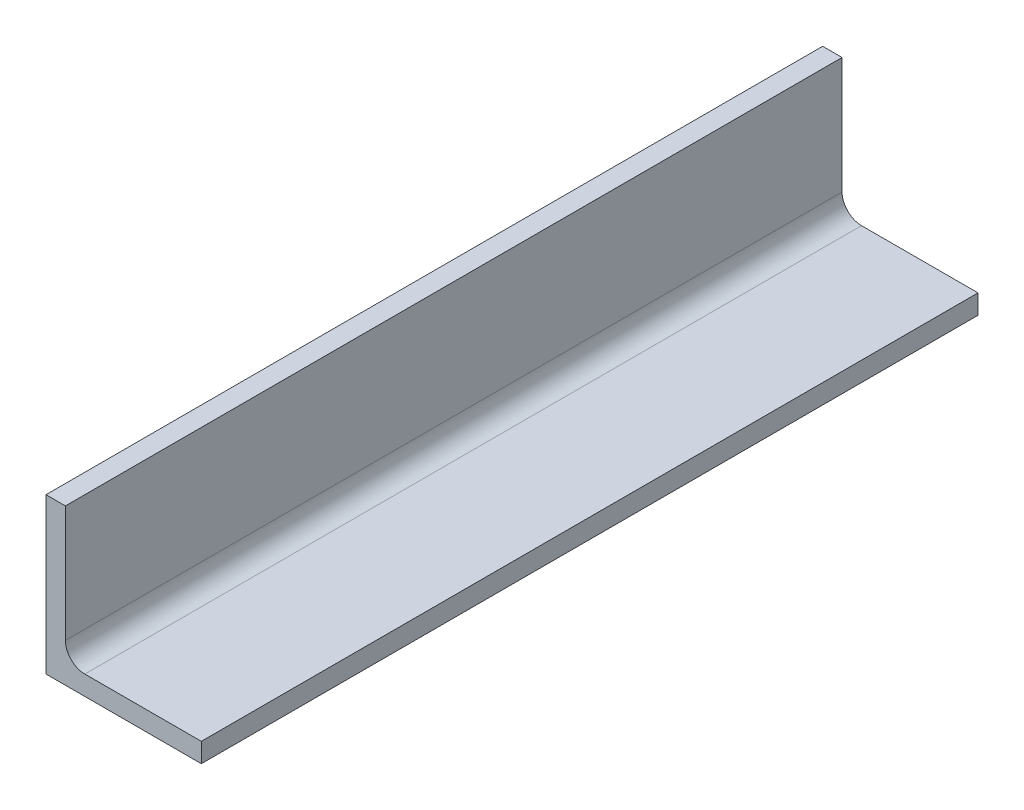
ISO-10303-21;
HEADER;
FILE_DESCRIPTION(('STEP AP214'),'2;1');
FILE_NAME('part.step','',(''),(''),'','','');
FILE_SCHEMA(('AUTOMOTIVE_DESIGN { 1 0 10303 214 1 1 1 1 }'));
ENDSEC;
DATA;
#1=APPLICATION_CONTEXT('core data for automotive mechanical design processes');
#2=APPLICATION_PROTOCOL_DEFINITION('international standard','automotive_design',2000,#1);
#3=PRODUCT_CONTEXT('',#1,'mechanical');
#4=PRODUCT('Part','Part','',(#3));
#5=PRODUCT_RELATED_PRODUCT_CATEGORY('part','',(#4));
#6=PRODUCT_DEFINITION_FORMATION('','',#4);
#7=PRODUCT_DEFINITION_CONTEXT('part definition',#1,'design');
#8=PRODUCT_DEFINITION('design','',#6,#7);
#9=PRODUCT_DEFINITION_SHAPE('','',#8);
#10=(LENGTH_UNIT() NAMED_UNIT(*) SI_UNIT(.MILLI.,.METRE.));
#11=(NAMED_UNIT(*) PLANE_ANGLE_UNIT() SI_UNIT($,.RADIAN.));
#12=(NAMED_UNIT(*) SI_UNIT($,.STERADIAN.) SOLID_ANGLE_UNIT());
#13=UNCERTAINTY_MEASURE_WITH_UNIT(LENGTH_MEASURE(1.E-05),#10,'distance_accuracy_value','');
#14=(GEOMETRIC_REPRESENTATION_CONTEXT(3) GLOBAL_UNCERTAINTY_ASSIGNED_CONTEXT((#13)) GLOBAL_UNIT_ASSIGNED_CONTEXT((#10,
#11,#12)) REPRESENTATION_CONTEXT('',''));
#15=CARTESIAN_POINT('',(0.,0.,0.));
#16=DIRECTION('',(0.,0.,1.));
#17=DIRECTION('',(1.,0.,0.));
#18=AXIS2_PLACEMENT_3D('',#15,#16,#17);
#19=CARTESIAN_POINT('',(50.8,0.,127.));
#20=DIRECTION('',(0.,1.,0.));
#21=DIRECTION('',(-1.,0.,0.));
#22=AXIS2_PLACEMENT_3D('',#19,#20,#21);
#23=PLANE('',#22);
#24=DIRECTION('',(1.,0.,0.));
#25=VECTOR('',#24,1.);
#26=CARTESIAN_POINT('',(50.8,0.,-127.));
#27=LINE('',#26,#25);
#28=CARTESIAN_POINT('',(0.,0.,-127.));
#29=VERTEX_POINT('',#28);
#30=CARTESIAN_POINT('',(50.8,0.,-127.));
#31=VERTEX_POINT('',#30);
#32=EDGE_CURVE('E124',#29,#31,#27,.T.);
#33=ORIENTED_EDGE('',*,*,#32,.T.);
#34=DIRECTION('',(0.,0.,-1.));
#35=VECTOR('',#34,1.);
#36=CARTESIAN_POINT('',(50.8,0.,127.));
#37=LINE('',#36,#35);
#38=CARTESIAN_POINT('',(50.8,0.,127.));
#39=VERTEX_POINT('',#38);
#40=EDGE_CURVE('E11',#39,#31,#37,.T.);
#41=ORIENTED_EDGE('',*,*,#40,.F.);
#42=DIRECTION('',(1.,0.,0.));
#43=VECTOR('',#42,1.);
#44=CARTESIAN_POINT('',(50.8,0.,127.));
#45=LINE('',#44,#43);
#46=CARTESIAN_POINT('',(0.,0.,127.));
#47=VERTEX_POINT('',#46);
#48=EDGE_CURVE('E136',#47,#39,#45,.T.);
#49=ORIENTED_EDGE('',*,*,#48,.F.);
#50=DIRECTION('',(0.,0.,-1.));
#51=VECTOR('',#50,1.);
#52=CARTESIAN_POINT('',(0.,0.,127.));
#53=LINE('',#52,#51);
#54=EDGE_CURVE('E120',#47,#29,#53,.T.);
#55=ORIENTED_EDGE('',*,*,#54,.T.);
#56=EDGE_LOOP('',(#33,#41,#49,#55));
#57=FACE_BOUND('',#56,.T.);
#58=ADVANCED_FACE('F34',(#57),#23,.F.);
#59=CARTESIAN_POINT('',(50.8,6.35000000000001,127.));
#60=DIRECTION('',(-1.,0.,0.));
#61=DIRECTION('',(0.,0.,1.));
#62=AXIS2_PLACEMENT_3D('',#59,#60,#61);
#63=PLANE('',#62);
#64=DIRECTION('',(0.,1.,0.));
#65=VECTOR('',#64,1.);
#66=CARTESIAN_POINT('',(50.8,6.35000000000001,-127.));
#67=LINE('',#66,#65);
#68=CARTESIAN_POINT('',(50.8,6.35000000000001,-127.));
#69=VERTEX_POINT('',#68);
#70=EDGE_CURVE('E127',#31,#69,#67,.T.);
#71=ORIENTED_EDGE('',*,*,#70,.T.);
#72=DIRECTION('',(0.,0.,-1.));
#73=VECTOR('',#72,1.);
#74=CARTESIAN_POINT('',(50.8,6.35000000000001,127.));
#75=LINE('',#74,#73);
#76=CARTESIAN_POINT('',(50.8,6.35000000000001,127.));
#77=VERTEX_POINT('',#76);
#78=EDGE_CURVE('E42',#77,#69,#75,.T.);
#79=ORIENTED_EDGE('',*,*,#78,.F.);
#80=DIRECTION('',(0.,1.,0.));
#81=VECTOR('',#80,1.);
#82=CARTESIAN_POINT('',(50.8,6.35000000000001,127.));
#83=LINE('',#82,#81);
#84=EDGE_CURVE('E90',#39,#77,#83,.T.);
#85=ORIENTED_EDGE('',*,*,#84,.F.);
#86=ORIENTED_EDGE('',*,*,#40,.T.);
#87=EDGE_LOOP('',(#71,#79,#85,#86));
#88=FACE_BOUND('',#87,.T.);
#89=ADVANCED_FACE('F161',(#88),#63,.F.);
#90=CARTESIAN_POINT('',(12.7,6.35000000000001,127.));
#91=DIRECTION('',(0.,-1.,0.));
#92=DIRECTION('',(0.,0.,-1.));
#93=AXIS2_PLACEMENT_3D('',#90,#91,#92);
#94=PLANE('',#93);
#95=DIRECTION('',(-1.,0.,0.));
#96=VECTOR('',#95,1.);
#97=CARTESIAN_POINT('',(12.7,6.35000000000001,-127.));
#98=LINE('',#97,#96);
#99=CARTESIAN_POINT('',(12.7,6.35000000000001,-127.));
#100=VERTEX_POINT('',#99);
#101=EDGE_CURVE('E129',#69,#100,#98,.T.);
#102=ORIENTED_EDGE('',*,*,#101,.T.);
#103=DIRECTION('',(0.,0.,-1.));
#104=VECTOR('',#103,1.);
#105=CARTESIAN_POINT('',(12.7,6.35000000000001,127.));
#106=LINE('',#105,#104);
#107=CARTESIAN_POINT('',(12.7,6.35000000000001,127.));
#108=VERTEX_POINT('',#107);
#109=EDGE_CURVE('E140',#108,#100,#106,.T.);
#110=ORIENTED_EDGE('',*,*,#109,.F.);
#111=DIRECTION('',(-1.,0.,0.));
#112=VECTOR('',#111,1.);
#113=CARTESIAN_POINT('',(12.7,6.35000000000001,127.));
#114=LINE('',#113,#112);
#115=EDGE_CURVE('E148',#77,#108,#114,.T.);
#116=ORIENTED_EDGE('',*,*,#115,.F.);
#117=ORIENTED_EDGE('',*,*,#78,.T.);
#118=EDGE_LOOP('',(#102,#110,#116,#117));
#119=FACE_BOUND('',#118,.T.);
#120=ADVANCED_FACE('F146',(#119),#94,.F.);
#121=CARTESIAN_POINT('',(12.7,12.7,127.));
#122=DIRECTION('',(0.,0.,-1.));
#123=DIRECTION('',(-1.,0.,0.));
#124=AXIS2_PLACEMENT_3D('',#121,#122,#123);
#125=CYLINDRICAL_SURFACE('',#124,6.35);
#126=CARTESIAN_POINT('',(12.7,12.7,-127.));
#127=DIRECTION('',(0.,0.,-1.));
#128=DIRECTION('',(-1.,0.,0.));
#129=AXIS2_PLACEMENT_3D('',#126,#127,#128);
#130=CIRCLE('',#129,6.35);
#131=CARTESIAN_POINT('',(6.35,12.7,-127.));
#132=VERTEX_POINT('',#131);
#133=EDGE_CURVE('E131',#100,#132,#130,.T.);
#134=ORIENTED_EDGE('',*,*,#133,.T.);
#135=DIRECTION('',(0.,0.,-1.));
#136=VECTOR('',#135,1.);
#137=CARTESIAN_POINT('',(6.35,12.7,127.));
#138=LINE('',#137,#136);
#139=CARTESIAN_POINT('',(6.35,12.7,127.));
#140=VERTEX_POINT('',#139);
#141=EDGE_CURVE('E115',#140,#132,#138,.T.);
#142=ORIENTED_EDGE('',*,*,#141,.F.);
#143=CARTESIAN_POINT('',(12.7,12.7,127.));
#144=DIRECTION('',(0.,0.,-1.));
#145=DIRECTION('',(-1.,0.,0.));
#146=AXIS2_PLACEMENT_3D('',#143,#144,#145);
#147=CIRCLE('',#146,6.35);
#148=EDGE_CURVE('E106',#108,#140,#147,.T.);
#149=ORIENTED_EDGE('',*,*,#148,.F.);
#150=ORIENTED_EDGE('',*,*,#109,.T.);
#151=EDGE_LOOP('',(#134,#142,#149,#150));
#152=FACE_BOUND('',#151,.T.);
#153=ADVANCED_FACE('F154',(#152),#125,.F.);
#154=CARTESIAN_POINT('',(6.35,50.8,127.));
#155=DIRECTION('',(-1.,0.,0.));
#156=DIRECTION('',(0.,-1.,0.));
#157=AXIS2_PLACEMENT_3D('',#154,#155,#156);
#158=PLANE('',#157);
#159=DIRECTION('',(0.,1.,0.));
#160=VECTOR('',#159,1.);
#161=CARTESIAN_POINT('',(6.35,50.8,-127.));
#162=LINE('',#161,#160);
#163=CARTESIAN_POINT('',(6.35,50.8,-127.));
#164=VERTEX_POINT('',#163);
#165=EDGE_CURVE('E114',#132,#164,#162,.T.);
#166=ORIENTED_EDGE('',*,*,#165,.T.);
#167=DIRECTION('',(0.,0.,-1.));
#168=VECTOR('',#167,1.);
#169=CARTESIAN_POINT('',(6.35,50.8,127.));
#170=LINE('',#169,#168);
#171=CARTESIAN_POINT('',(6.35,50.8,127.));
#172=VERTEX_POINT('',#171);
#173=EDGE_CURVE('E111',#172,#164,#170,.T.);
#174=ORIENTED_EDGE('',*,*,#173,.F.);
#175=DIRECTION('',(0.,1.,0.));
#176=VECTOR('',#175,1.);
#177=CARTESIAN_POINT('',(6.35,50.8,127.));
#178=LINE('',#177,#176);
#179=EDGE_CURVE('E100',#140,#172,#178,.T.);
#180=ORIENTED_EDGE('',*,*,#179,.F.);
#181=ORIENTED_EDGE('',*,*,#141,.T.);
#182=EDGE_LOOP('',(#166,#174,#180,#181));
#183=FACE_BOUND('',#182,.T.);
#184=ADVANCED_FACE('F112',(#183),#158,.F.);
#185=CARTESIAN_POINT('',(0.,50.8,127.));
#186=DIRECTION('',(0.,-1.,0.));
#187=DIRECTION('',(0.,0.,-1.));
#188=AXIS2_PLACEMENT_3D('',#185,#186,#187);
#189=PLANE('',#188);
#190=DIRECTION('',(-1.,0.,0.));
#191=VECTOR('',#190,1.);
#192=CARTESIAN_POINT('',(0.,50.8,-127.));
#193=LINE('',#192,#191);
#194=CARTESIAN_POINT('',(0.,50.8,-127.));
#195=VERTEX_POINT('',#194);
#196=EDGE_CURVE('E76',#164,#195,#193,.T.);
#197=ORIENTED_EDGE('',*,*,#196,.T.);
#198=DIRECTION('',(0.,0.,-1.));
#199=VECTOR('',#198,1.);
#200=CARTESIAN_POINT('',(0.,50.8,127.));
#201=LINE('',#200,#199);
#202=CARTESIAN_POINT('',(0.,50.8,127.));
#203=VERTEX_POINT('',#202);
#204=EDGE_CURVE('E116',#203,#195,#201,.T.);
#205=ORIENTED_EDGE('',*,*,#204,.F.);
#206=DIRECTION('',(-1.,0.,0.));
#207=VECTOR('',#206,1.);
#208=CARTESIAN_POINT('',(0.,50.8,127.));
#209=LINE('',#208,#207);
#210=EDGE_CURVE('E104',#172,#203,#209,.T.);
#211=ORIENTED_EDGE('',*,*,#210,.F.);
#212=ORIENTED_EDGE('',*,*,#173,.T.);
#213=EDGE_LOOP('',(#197,#205,#211,#212));
#214=FACE_BOUND('',#213,.T.);
#215=ADVANCED_FACE('F118',(#214),#189,.F.);
#216=CARTESIAN_POINT('',(0.,0.,127.));
#217=DIRECTION('',(1.,0.,0.));
#218=DIRECTION('',(0.,0.,-1.));
#219=AXIS2_PLACEMENT_3D('',#216,#217,#218);
#220=PLANE('',#219);
#221=DIRECTION('',(0.,-1.,0.));
#222=VECTOR('',#221,1.);
#223=CARTESIAN_POINT('',(0.,0.,-127.));
#224=LINE('',#223,#222);
#225=EDGE_CURVE('E82',#195,#29,#224,.T.);
#226=ORIENTED_EDGE('',*,*,#225,.T.);
#227=ORIENTED_EDGE('',*,*,#54,.F.);
#228=DIRECTION('',(0.,-1.,0.));
#229=VECTOR('',#228,1.);
#230=CARTESIAN_POINT('',(0.,0.,127.));
#231=LINE('',#230,#229);
#232=EDGE_CURVE('E50',#203,#47,#231,.T.);
#233=ORIENTED_EDGE('',*,*,#232,.F.);
#234=ORIENTED_EDGE('',*,*,#204,.T.);
#235=EDGE_LOOP('',(#226,#227,#233,#234));
#236=FACE_BOUND('',#235,.T.);
#237=ADVANCED_FACE('F175',(#236),#220,.F.);
#238=CARTESIAN_POINT('',(12.7,12.7,127.));
#239=DIRECTION('',(0.,0.,-1.));
#240=DIRECTION('',(-1.,0.,0.));
#241=AXIS2_PLACEMENT_3D('',#238,#239,#240);
#242=PLANE('',#241);
#243=ORIENTED_EDGE('',*,*,#48,.T.);
#244=ORIENTED_EDGE('',*,*,#84,.T.);
#245=ORIENTED_EDGE('',*,*,#115,.T.);
#246=ORIENTED_EDGE('',*,*,#148,.T.);
#247=ORIENTED_EDGE('',*,*,#179,.T.);
#248=ORIENTED_EDGE('',*,*,#210,.T.);
#249=ORIENTED_EDGE('',*,*,#232,.T.);
#250=EDGE_LOOP('',(#243,#244,#245,#246,#247,#248,#249));
#251=FACE_BOUND('',#250,.T.);
#252=ADVANCED_FACE('F102',(#251),#242,.F.);
#253=CARTESIAN_POINT('',(12.7,12.7,-127.));
#254=DIRECTION('',(0.,0.,-1.));
#255=DIRECTION('',(-1.,0.,0.));
#256=AXIS2_PLACEMENT_3D('',#253,#254,#255);
#257=PLANE('',#256);
#258=ORIENTED_EDGE('',*,*,#32,.F.);
#259=ORIENTED_EDGE('',*,*,#225,.F.);
#260=ORIENTED_EDGE('',*,*,#196,.F.);
#261=ORIENTED_EDGE('',*,*,#165,.F.);
#262=ORIENTED_EDGE('',*,*,#133,.F.);
#263=ORIENTED_EDGE('',*,*,#101,.F.);
#264=ORIENTED_EDGE('',*,*,#70,.F.);
#265=EDGE_LOOP('',(#258,#259,#260,#261,#262,#263,#264));
#266=FACE_BOUND('',#265,.T.);
#267=ADVANCED_FACE('F152',(#266),#257,.T.);
#268=CLOSED_SHELL('',(#58,#89,#120,#153,#184,#215,#237,#252,#267));
#269=MANIFOLD_SOLID_BREP('B2',#268);
#270=ADVANCED_BREP_SHAPE_REPRESENTATION('',(#18,#269),#14);
#271=SHAPE_DEFINITION_REPRESENTATION(#9,#270);
ENDSEC;
END-ISO-10303-21;
